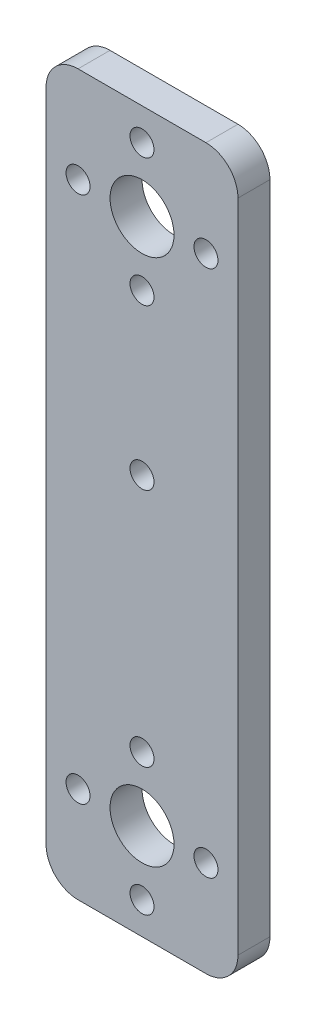
ISO-10303-21;
HEADER;
FILE_DESCRIPTION(('STEP AP214'),'2;1');
FILE_NAME('part.step','',(''),(''),'','','');
FILE_SCHEMA(('AUTOMOTIVE_DESIGN { 1 0 10303 214 1 1 1 1 }'));
ENDSEC;
DATA;
#1=APPLICATION_CONTEXT('core data for automotive mechanical design processes');
#2=APPLICATION_PROTOCOL_DEFINITION('international standard','automotive_design',2000,#1);
#3=PRODUCT_CONTEXT('',#1,'mechanical');
#4=PRODUCT('Part','Part','',(#3));
#5=PRODUCT_RELATED_PRODUCT_CATEGORY('part','',(#4));
#6=PRODUCT_DEFINITION_FORMATION('','',#4);
#7=PRODUCT_DEFINITION_CONTEXT('part definition',#1,'design');
#8=PRODUCT_DEFINITION('design','',#6,#7);
#9=PRODUCT_DEFINITION_SHAPE('','',#8);
#10=(LENGTH_UNIT() NAMED_UNIT(*) SI_UNIT(.MILLI.,.METRE.));
#11=(NAMED_UNIT(*) PLANE_ANGLE_UNIT() SI_UNIT($,.RADIAN.));
#12=(NAMED_UNIT(*) SI_UNIT($,.STERADIAN.) SOLID_ANGLE_UNIT());
#13=UNCERTAINTY_MEASURE_WITH_UNIT(LENGTH_MEASURE(1.E-05),#10,'distance_accuracy_value','');
#14=(GEOMETRIC_REPRESENTATION_CONTEXT(3) GLOBAL_UNCERTAINTY_ASSIGNED_CONTEXT((#13)) GLOBAL_UNIT_ASSIGNED_CONTEXT((#10,
#11,#12)) REPRESENTATION_CONTEXT('',''));
#15=CARTESIAN_POINT('',(0.,0.,0.));
#16=DIRECTION('',(0.,0.,1.));
#17=DIRECTION('',(1.,0.,0.));
#18=AXIS2_PLACEMENT_3D('',#15,#16,#17);
#19=CARTESIAN_POINT('',(-57.2966754660947,34.9503189792664,4.));
#20=DIRECTION('',(0.,1.,0.));
#21=DIRECTION('',(0.,0.,1.));
#22=AXIS2_PLACEMENT_3D('',#19,#20,#21);
#23=PLANE('',#22);
#24=DIRECTION('',(1.,0.,0.));
#25=VECTOR('',#24,1.);
#26=CARTESIAN_POINT('',(-57.2966754660947,34.9503189792664,0.));
#27=LINE('',#26,#25);
#28=CARTESIAN_POINT('',(-53.2966754660947,34.9503189792664,0.));
#29=VERTEX_POINT('',#28);
#30=CARTESIAN_POINT('',(-37.2966754660947,34.9503189792664,0.));
#31=VERTEX_POINT('',#30);
#32=EDGE_CURVE('E128',#29,#31,#27,.T.);
#33=ORIENTED_EDGE('',*,*,#32,.F.);
#34=DIRECTION('',(0.,0.,-1.));
#35=VECTOR('',#34,1.);
#36=CARTESIAN_POINT('',(-53.2966754660947,34.9503189792664,4.));
#37=LINE('',#36,#35);
#38=CARTESIAN_POINT('',(-53.2966754660947,34.9503189792664,4.));
#39=VERTEX_POINT('',#38);
#40=EDGE_CURVE('E11',#29,#39,#37,.F.);
#41=ORIENTED_EDGE('',*,*,#40,.T.);
#42=DIRECTION('',(1.,0.,0.));
#43=VECTOR('',#42,1.);
#44=CARTESIAN_POINT('',(-57.2966754660947,34.9503189792664,4.));
#45=LINE('',#44,#43);
#46=CARTESIAN_POINT('',(-37.2966754660947,34.9503189792664,4.));
#47=VERTEX_POINT('',#46);
#48=EDGE_CURVE('E126',#39,#47,#45,.T.);
#49=ORIENTED_EDGE('',*,*,#48,.T.);
#50=DIRECTION('',(0.,0.,-1.));
#51=VECTOR('',#50,1.);
#52=CARTESIAN_POINT('',(-37.2966754660947,34.9503189792664,4.));
#53=LINE('',#52,#51);
#54=EDGE_CURVE('E40',#47,#31,#53,.T.);
#55=ORIENTED_EDGE('',*,*,#54,.T.);
#56=EDGE_LOOP('',(#33,#41,#49,#55));
#57=FACE_BOUND('',#56,.T.);
#58=ADVANCED_FACE('F32',(#57),#23,.T.);
#59=CARTESIAN_POINT('',(-57.2966754660947,34.9503189792664,4.));
#60=DIRECTION('',(1.,0.,0.));
#61=DIRECTION('',(0.,1.,0.));
#62=AXIS2_PLACEMENT_3D('',#59,#60,#61);
#63=PLANE('',#62);
#64=DIRECTION('',(0.,-1.,0.));
#65=VECTOR('',#64,1.);
#66=CARTESIAN_POINT('',(-57.2966754660947,34.9503189792664,0.));
#67=LINE('',#66,#65);
#68=CARTESIAN_POINT('',(-57.2966754660947,30.9503189792664,0.));
#69=VERTEX_POINT('',#68);
#70=CARTESIAN_POINT('',(-57.2966754660947,-51.0496810207336,0.));
#71=VERTEX_POINT('',#70);
#72=EDGE_CURVE('E123',#69,#71,#67,.T.);
#73=ORIENTED_EDGE('',*,*,#72,.T.);
#74=DIRECTION('',(0.,0.,-1.));
#75=VECTOR('',#74,1.);
#76=CARTESIAN_POINT('',(-57.2966754660947,-51.0496810207336,4.));
#77=LINE('',#76,#75);
#78=CARTESIAN_POINT('',(-57.2966754660947,-51.0496810207336,4.));
#79=VERTEX_POINT('',#78);
#80=EDGE_CURVE('E103',#71,#79,#77,.F.);
#81=ORIENTED_EDGE('',*,*,#80,.T.);
#82=DIRECTION('',(0.,-1.,0.));
#83=VECTOR('',#82,1.);
#84=CARTESIAN_POINT('',(-57.2966754660947,34.9503189792664,4.));
#85=LINE('',#84,#83);
#86=CARTESIAN_POINT('',(-57.2966754660947,30.9503189792664,4.));
#87=VERTEX_POINT('',#86);
#88=EDGE_CURVE('E132',#87,#79,#85,.T.);
#89=ORIENTED_EDGE('',*,*,#88,.F.);
#90=DIRECTION('',(0.,0.,-1.));
#91=VECTOR('',#90,1.);
#92=CARTESIAN_POINT('',(-57.2966754660947,30.9503189792664,0.));
#93=LINE('',#92,#91);
#94=EDGE_CURVE('E108',#87,#69,#93,.T.);
#95=ORIENTED_EDGE('',*,*,#94,.T.);
#96=EDGE_LOOP('',(#73,#81,#89,#95));
#97=FACE_BOUND('',#96,.T.);
#98=ADVANCED_FACE('F271',(#97),#63,.F.);
#99=CARTESIAN_POINT('',(-57.2966754660947,-55.0496810207336,4.));
#100=DIRECTION('',(0.,1.,0.));
#101=DIRECTION('',(0.,0.,1.));
#102=AXIS2_PLACEMENT_3D('',#99,#100,#101);
#103=PLANE('',#102);
#104=DIRECTION('',(1.,0.,0.));
#105=VECTOR('',#104,1.);
#106=CARTESIAN_POINT('',(-57.2966754660947,-55.0496810207336,4.));
#107=LINE('',#106,#105);
#108=CARTESIAN_POINT('',(-53.2966754660947,-55.0496810207336,4.));
#109=VERTEX_POINT('',#108);
#110=CARTESIAN_POINT('',(-37.2966754660947,-55.0496810207336,4.));
#111=VERTEX_POINT('',#110);
#112=EDGE_CURVE('E117',#109,#111,#107,.T.);
#113=ORIENTED_EDGE('',*,*,#112,.F.);
#114=DIRECTION('',(0.,0.,-1.));
#115=VECTOR('',#114,1.);
#116=CARTESIAN_POINT('',(-53.2966754660947,-55.0496810207336,4.));
#117=LINE('',#116,#115);
#118=CARTESIAN_POINT('',(-53.2966754660947,-55.0496810207336,0.));
#119=VERTEX_POINT('',#118);
#120=EDGE_CURVE('E102',#109,#119,#117,.T.);
#121=ORIENTED_EDGE('',*,*,#120,.T.);
#122=DIRECTION('',(1.,0.,0.));
#123=VECTOR('',#122,1.);
#124=CARTESIAN_POINT('',(-57.2966754660947,-55.0496810207336,0.));
#125=LINE('',#124,#123);
#126=CARTESIAN_POINT('',(-37.2966754660947,-55.0496810207336,0.));
#127=VERTEX_POINT('',#126);
#128=EDGE_CURVE('E115',#119,#127,#125,.T.);
#129=ORIENTED_EDGE('',*,*,#128,.T.);
#130=DIRECTION('',(0.,0.,-1.));
#131=VECTOR('',#130,1.);
#132=CARTESIAN_POINT('',(-37.2966754660947,-55.0496810207336,4.));
#133=LINE('',#132,#131);
#134=EDGE_CURVE('E119',#127,#111,#133,.F.);
#135=ORIENTED_EDGE('',*,*,#134,.T.);
#136=EDGE_LOOP('',(#113,#121,#129,#135));
#137=FACE_BOUND('',#136,.T.);
#138=ADVANCED_FACE('F114',(#137),#103,.F.);
#139=CARTESIAN_POINT('',(-33.2966754660947,34.9503189792664,4.));
#140=DIRECTION('',(1.,0.,0.));
#141=DIRECTION('',(0.,1.,0.));
#142=AXIS2_PLACEMENT_3D('',#139,#140,#141);
#143=PLANE('',#142);
#144=DIRECTION('',(0.,-1.,0.));
#145=VECTOR('',#144,1.);
#146=CARTESIAN_POINT('',(-33.2966754660947,34.9503189792664,4.));
#147=LINE('',#146,#145);
#148=CARTESIAN_POINT('',(-33.2966754660947,30.9503189792664,4.));
#149=VERTEX_POINT('',#148);
#150=CARTESIAN_POINT('',(-33.2966754660947,-51.0496810207336,4.));
#151=VERTEX_POINT('',#150);
#152=EDGE_CURVE('E169',#149,#151,#147,.T.);
#153=ORIENTED_EDGE('',*,*,#152,.T.);
#154=DIRECTION('',(0.,0.,-1.));
#155=VECTOR('',#154,1.);
#156=CARTESIAN_POINT('',(-33.2966754660947,-51.0496810207336,0.));
#157=LINE('',#156,#155);
#158=CARTESIAN_POINT('',(-33.2966754660947,-51.0496810207336,0.));
#159=VERTEX_POINT('',#158);
#160=EDGE_CURVE('E149',#151,#159,#157,.T.);
#161=ORIENTED_EDGE('',*,*,#160,.T.);
#162=DIRECTION('',(0.,-1.,0.));
#163=VECTOR('',#162,1.);
#164=CARTESIAN_POINT('',(-33.2966754660947,34.9503189792664,0.));
#165=LINE('',#164,#163);
#166=CARTESIAN_POINT('',(-33.2966754660947,30.9503189792664,0.));
#167=VERTEX_POINT('',#166);
#168=EDGE_CURVE('E124',#167,#159,#165,.T.);
#169=ORIENTED_EDGE('',*,*,#168,.F.);
#170=DIRECTION('',(0.,0.,-1.));
#171=VECTOR('',#170,1.);
#172=CARTESIAN_POINT('',(-33.2966754660947,30.9503189792664,4.));
#173=LINE('',#172,#171);
#174=EDGE_CURVE('E54',#167,#149,#173,.F.);
#175=ORIENTED_EDGE('',*,*,#174,.T.);
#176=EDGE_LOOP('',(#153,#161,#169,#175));
#177=FACE_BOUND('',#176,.T.);
#178=ADVANCED_FACE('F246',(#177),#143,.T.);
#179=CARTESIAN_POINT('',(0.,0.,4.));
#180=DIRECTION('',(0.,0.,-1.));
#181=DIRECTION('',(-1.,0.,0.));
#182=AXIS2_PLACEMENT_3D('',#179,#180,#181);
#183=PLANE('',#182);
#184=CARTESIAN_POINT('',(-45.2966754660948,-5.04968102073364,4.));
#185=DIRECTION('',(0.,0.,1.));
#186=DIRECTION('',(1.,0.,0.));
#187=AXIS2_PLACEMENT_3D('',#184,#185,#186);
#188=CIRCLE('',#187,1.5);
#189=CARTESIAN_POINT('',(-43.7966754660948,-5.04968102073364,4.));
#190=VERTEX_POINT('',#189);
#191=EDGE_CURVE('E229',#190,#190,#188,.T.);
#192=ORIENTED_EDGE('',*,*,#191,.F.);
#193=EDGE_LOOP('',(#192));
#194=FACE_BOUND('',#193,.T.);
#195=CARTESIAN_POINT('',(-45.2966754660948,14.9503189792664,4.));
#196=DIRECTION('',(0.,0.,1.));
#197=DIRECTION('',(1.,0.,0.));
#198=AXIS2_PLACEMENT_3D('',#195,#196,#197);
#199=CIRCLE('',#198,1.5);
#200=CARTESIAN_POINT('',(-43.7966754660948,14.9503189792664,4.));
#201=VERTEX_POINT('',#200);
#202=EDGE_CURVE('E220',#201,#201,#199,.T.);
#203=ORIENTED_EDGE('',*,*,#202,.F.);
#204=EDGE_LOOP('',(#203));
#205=FACE_BOUND('',#204,.T.);
#206=CARTESIAN_POINT('',(-37.2966754660949,22.9503189792664,4.));
#207=DIRECTION('',(0.,0.,1.));
#208=DIRECTION('',(1.,0.,0.));
#209=AXIS2_PLACEMENT_3D('',#206,#207,#208);
#210=CIRCLE('',#209,1.5);
#211=CARTESIAN_POINT('',(-35.7966754660949,22.9503189792664,4.));
#212=VERTEX_POINT('',#211);
#213=EDGE_CURVE('E214',#212,#212,#210,.T.);
#214=ORIENTED_EDGE('',*,*,#213,.F.);
#215=EDGE_LOOP('',(#214));
#216=FACE_BOUND('',#215,.T.);
#217=CARTESIAN_POINT('',(-45.2966754660949,22.9503189792664,4.));
#218=DIRECTION('',(0.,0.,1.));
#219=DIRECTION('',(1.,0.,0.));
#220=AXIS2_PLACEMENT_3D('',#217,#218,#219);
#221=CIRCLE('',#220,4.);
#222=CARTESIAN_POINT('',(-41.2966754660949,22.9503189792664,4.));
#223=VERTEX_POINT('',#222);
#224=EDGE_CURVE('E208',#223,#223,#221,.T.);
#225=ORIENTED_EDGE('',*,*,#224,.F.);
#226=EDGE_LOOP('',(#225));
#227=FACE_BOUND('',#226,.T.);
#228=CARTESIAN_POINT('',(-45.2966754660949,30.9503189792664,4.));
#229=DIRECTION('',(0.,0.,1.));
#230=DIRECTION('',(1.,0.,0.));
#231=AXIS2_PLACEMENT_3D('',#228,#229,#230);
#232=CIRCLE('',#231,1.5);
#233=CARTESIAN_POINT('',(-43.7966754660949,30.9503189792664,4.));
#234=VERTEX_POINT('',#233);
#235=EDGE_CURVE('E202',#234,#234,#232,.T.);
#236=ORIENTED_EDGE('',*,*,#235,.F.);
#237=EDGE_LOOP('',(#236));
#238=FACE_BOUND('',#237,.T.);
#239=CARTESIAN_POINT('',(-53.2966754660949,22.9503189792664,4.));
#240=DIRECTION('',(0.,0.,1.));
#241=DIRECTION('',(1.,0.,0.));
#242=AXIS2_PLACEMENT_3D('',#239,#240,#241);
#243=CIRCLE('',#242,1.5);
#244=CARTESIAN_POINT('',(-51.7966754660949,22.9503189792664,4.));
#245=VERTEX_POINT('',#244);
#246=EDGE_CURVE('E196',#245,#245,#243,.T.);
#247=ORIENTED_EDGE('',*,*,#246,.F.);
#248=EDGE_LOOP('',(#247));
#249=FACE_BOUND('',#248,.T.);
#250=CARTESIAN_POINT('',(-53.2966754660947,-43.0496810207337,4.));
#251=DIRECTION('',(0.,0.,1.));
#252=DIRECTION('',(1.,0.,0.));
#253=AXIS2_PLACEMENT_3D('',#250,#251,#252);
#254=CIRCLE('',#253,1.5);
#255=CARTESIAN_POINT('',(-51.7966754660947,-43.0496810207337,4.));
#256=VERTEX_POINT('',#255);
#257=EDGE_CURVE('E190',#256,#256,#254,.T.);
#258=ORIENTED_EDGE('',*,*,#257,.F.);
#259=EDGE_LOOP('',(#258));
#260=FACE_BOUND('',#259,.T.);
#261=CARTESIAN_POINT('',(-45.2966754660947,-51.0496810207337,4.));
#262=DIRECTION('',(0.,0.,1.));
#263=DIRECTION('',(1.,0.,0.));
#264=AXIS2_PLACEMENT_3D('',#261,#262,#263);
#265=CIRCLE('',#264,1.5);
#266=CARTESIAN_POINT('',(-43.7966754660947,-51.0496810207337,4.));
#267=VERTEX_POINT('',#266);
#268=EDGE_CURVE('E184',#267,#267,#265,.T.);
#269=ORIENTED_EDGE('',*,*,#268,.F.);
#270=EDGE_LOOP('',(#269));
#271=FACE_BOUND('',#270,.T.);
#272=CARTESIAN_POINT('',(-37.2966754660947,-43.0496810207336,4.));
#273=DIRECTION('',(0.,0.,1.));
#274=DIRECTION('',(1.,0.,0.));
#275=AXIS2_PLACEMENT_3D('',#272,#273,#274);
#276=CIRCLE('',#275,1.5);
#277=CARTESIAN_POINT('',(-35.7966754660947,-43.0496810207336,4.));
#278=VERTEX_POINT('',#277);
#279=EDGE_CURVE('E178',#278,#278,#276,.T.);
#280=ORIENTED_EDGE('',*,*,#279,.F.);
#281=EDGE_LOOP('',(#280));
#282=FACE_BOUND('',#281,.T.);
#283=CARTESIAN_POINT('',(-45.2966754660947,-43.0496810207337,4.));
#284=DIRECTION('',(0.,0.,1.));
#285=DIRECTION('',(1.,0.,0.));
#286=AXIS2_PLACEMENT_3D('',#283,#284,#285);
#287=CIRCLE('',#286,4.);
#288=CARTESIAN_POINT('',(-41.2966754660947,-43.0496810207337,4.));
#289=VERTEX_POINT('',#288);
#290=EDGE_CURVE('E173',#289,#289,#287,.T.);
#291=ORIENTED_EDGE('',*,*,#290,.F.);
#292=EDGE_LOOP('',(#291));
#293=FACE_BOUND('',#292,.T.);
#294=CARTESIAN_POINT('',(-45.2966754660947,-35.0496810207337,4.));
#295=DIRECTION('',(0.,0.,1.));
#296=DIRECTION('',(1.,0.,0.));
#297=AXIS2_PLACEMENT_3D('',#294,#295,#296);
#298=CIRCLE('',#297,1.5);
#299=CARTESIAN_POINT('',(-43.7966754660947,-35.0496810207337,4.));
#300=VERTEX_POINT('',#299);
#301=EDGE_CURVE('E163',#300,#300,#298,.T.);
#302=ORIENTED_EDGE('',*,*,#301,.F.);
#303=EDGE_LOOP('',(#302));
#304=FACE_BOUND('',#303,.T.);
#305=ORIENTED_EDGE('',*,*,#88,.T.);
#306=CARTESIAN_POINT('',(-53.2966754660947,-51.0496810207336,4.));
#307=DIRECTION('',(0.,0.,-1.));
#308=DIRECTION('',(-1.,0.,0.));
#309=AXIS2_PLACEMENT_3D('',#306,#307,#308);
#310=CIRCLE('',#309,4.);
#311=EDGE_CURVE('E146',#79,#109,#310,.F.);
#312=ORIENTED_EDGE('',*,*,#311,.T.);
#313=ORIENTED_EDGE('',*,*,#112,.T.);
#314=CARTESIAN_POINT('',(-37.2966754660947,-51.0496810207336,4.));
#315=DIRECTION('',(0.,0.,-1.));
#316=DIRECTION('',(-1.,0.,0.));
#317=AXIS2_PLACEMENT_3D('',#314,#315,#316);
#318=CIRCLE('',#317,4.);
#319=EDGE_CURVE('E47',#111,#151,#318,.F.);
#320=ORIENTED_EDGE('',*,*,#319,.T.);
#321=ORIENTED_EDGE('',*,*,#152,.F.);
#322=CARTESIAN_POINT('',(-37.2966754660947,30.9503189792664,4.));
#323=DIRECTION('',(0.,0.,-1.));
#324=DIRECTION('',(-1.,0.,0.));
#325=AXIS2_PLACEMENT_3D('',#322,#323,#324);
#326=CIRCLE('',#325,4.);
#327=EDGE_CURVE('E141',#149,#47,#326,.F.);
#328=ORIENTED_EDGE('',*,*,#327,.T.);
#329=ORIENTED_EDGE('',*,*,#48,.F.);
#330=CARTESIAN_POINT('',(-53.2966754660947,30.9503189792664,4.));
#331=DIRECTION('',(0.,0.,-1.));
#332=DIRECTION('',(-1.,0.,0.));
#333=AXIS2_PLACEMENT_3D('',#330,#331,#332);
#334=CIRCLE('',#333,4.);
#335=EDGE_CURVE('E143',#39,#87,#334,.F.);
#336=ORIENTED_EDGE('',*,*,#335,.T.);
#337=EDGE_LOOP('',(#305,#312,#313,#320,#321,#328,#329,#336));
#338=FACE_BOUND('',#337,.T.);
#339=ADVANCED_FACE('F243',(#194,#205,#216,#227,#238,#249,#260,#271,#282,#293,#304,#338),#183,.F.);
#340=CARTESIAN_POINT('',(0.,0.,0.));
#341=DIRECTION('',(0.,0.,-1.));
#342=DIRECTION('',(-1.,0.,0.));
#343=AXIS2_PLACEMENT_3D('',#340,#341,#342);
#344=PLANE('',#343);
#345=CARTESIAN_POINT('',(-45.2966754660948,-5.04968102073364,0.));
#346=DIRECTION('',(0.,0.,1.));
#347=DIRECTION('',(1.,0.,0.));
#348=AXIS2_PLACEMENT_3D('',#345,#346,#347);
#349=CIRCLE('',#348,1.5);
#350=CARTESIAN_POINT('',(-43.7966754660948,-5.04968102073364,0.));
#351=VERTEX_POINT('',#350);
#352=EDGE_CURVE('E226',#351,#351,#349,.T.);
#353=ORIENTED_EDGE('',*,*,#352,.T.);
#354=EDGE_LOOP('',(#353));
#355=FACE_BOUND('',#354,.T.);
#356=CARTESIAN_POINT('',(-45.2966754660948,14.9503189792664,0.));
#357=DIRECTION('',(0.,0.,1.));
#358=DIRECTION('',(1.,0.,0.));
#359=AXIS2_PLACEMENT_3D('',#356,#357,#358);
#360=CIRCLE('',#359,1.5);
#361=CARTESIAN_POINT('',(-43.7966754660948,14.9503189792664,0.));
#362=VERTEX_POINT('',#361);
#363=EDGE_CURVE('E223',#362,#362,#360,.T.);
#364=ORIENTED_EDGE('',*,*,#363,.T.);
#365=EDGE_LOOP('',(#364));
#366=FACE_BOUND('',#365,.T.);
#367=CARTESIAN_POINT('',(-37.2966754660949,22.9503189792664,0.));
#368=DIRECTION('',(0.,0.,1.));
#369=DIRECTION('',(1.,0.,0.));
#370=AXIS2_PLACEMENT_3D('',#367,#368,#369);
#371=CIRCLE('',#370,1.5);
#372=CARTESIAN_POINT('',(-35.7966754660949,22.9503189792664,0.));
#373=VERTEX_POINT('',#372);
#374=EDGE_CURVE('E217',#373,#373,#371,.T.);
#375=ORIENTED_EDGE('',*,*,#374,.T.);
#376=EDGE_LOOP('',(#375));
#377=FACE_BOUND('',#376,.T.);
#378=CARTESIAN_POINT('',(-45.2966754660949,22.9503189792664,0.));
#379=DIRECTION('',(0.,0.,1.));
#380=DIRECTION('',(1.,0.,0.));
#381=AXIS2_PLACEMENT_3D('',#378,#379,#380);
#382=CIRCLE('',#381,4.);
#383=CARTESIAN_POINT('',(-41.2966754660949,22.9503189792664,0.));
#384=VERTEX_POINT('',#383);
#385=EDGE_CURVE('E211',#384,#384,#382,.T.);
#386=ORIENTED_EDGE('',*,*,#385,.T.);
#387=EDGE_LOOP('',(#386));
#388=FACE_BOUND('',#387,.T.);
#389=CARTESIAN_POINT('',(-45.2966754660949,30.9503189792664,0.));
#390=DIRECTION('',(0.,0.,1.));
#391=DIRECTION('',(1.,0.,0.));
#392=AXIS2_PLACEMENT_3D('',#389,#390,#391);
#393=CIRCLE('',#392,1.5);
#394=CARTESIAN_POINT('',(-43.7966754660949,30.9503189792664,0.));
#395=VERTEX_POINT('',#394);
#396=EDGE_CURVE('E205',#395,#395,#393,.T.);
#397=ORIENTED_EDGE('',*,*,#396,.T.);
#398=EDGE_LOOP('',(#397));
#399=FACE_BOUND('',#398,.T.);
#400=CARTESIAN_POINT('',(-53.2966754660949,22.9503189792664,0.));
#401=DIRECTION('',(0.,0.,1.));
#402=DIRECTION('',(1.,0.,0.));
#403=AXIS2_PLACEMENT_3D('',#400,#401,#402);
#404=CIRCLE('',#403,1.5);
#405=CARTESIAN_POINT('',(-51.7966754660949,22.9503189792664,0.));
#406=VERTEX_POINT('',#405);
#407=EDGE_CURVE('E199',#406,#406,#404,.T.);
#408=ORIENTED_EDGE('',*,*,#407,.T.);
#409=EDGE_LOOP('',(#408));
#410=FACE_BOUND('',#409,.T.);
#411=CARTESIAN_POINT('',(-53.2966754660947,-43.0496810207337,0.));
#412=DIRECTION('',(0.,0.,1.));
#413=DIRECTION('',(1.,0.,0.));
#414=AXIS2_PLACEMENT_3D('',#411,#412,#413);
#415=CIRCLE('',#414,1.5);
#416=CARTESIAN_POINT('',(-51.7966754660947,-43.0496810207337,0.));
#417=VERTEX_POINT('',#416);
#418=EDGE_CURVE('E193',#417,#417,#415,.T.);
#419=ORIENTED_EDGE('',*,*,#418,.T.);
#420=EDGE_LOOP('',(#419));
#421=FACE_BOUND('',#420,.T.);
#422=CARTESIAN_POINT('',(-45.2966754660947,-51.0496810207337,0.));
#423=DIRECTION('',(0.,0.,1.));
#424=DIRECTION('',(1.,0.,0.));
#425=AXIS2_PLACEMENT_3D('',#422,#423,#424);
#426=CIRCLE('',#425,1.5);
#427=CARTESIAN_POINT('',(-43.7966754660947,-51.0496810207337,0.));
#428=VERTEX_POINT('',#427);
#429=EDGE_CURVE('E187',#428,#428,#426,.T.);
#430=ORIENTED_EDGE('',*,*,#429,.T.);
#431=EDGE_LOOP('',(#430));
#432=FACE_BOUND('',#431,.T.);
#433=CARTESIAN_POINT('',(-37.2966754660947,-43.0496810207336,0.));
#434=DIRECTION('',(0.,0.,1.));
#435=DIRECTION('',(1.,0.,0.));
#436=AXIS2_PLACEMENT_3D('',#433,#434,#435);
#437=CIRCLE('',#436,1.5);
#438=CARTESIAN_POINT('',(-35.7966754660947,-43.0496810207336,0.));
#439=VERTEX_POINT('',#438);
#440=EDGE_CURVE('E181',#439,#439,#437,.T.);
#441=ORIENTED_EDGE('',*,*,#440,.T.);
#442=EDGE_LOOP('',(#441));
#443=FACE_BOUND('',#442,.T.);
#444=CARTESIAN_POINT('',(-45.2966754660947,-43.0496810207337,0.));
#445=DIRECTION('',(0.,0.,1.));
#446=DIRECTION('',(1.,0.,0.));
#447=AXIS2_PLACEMENT_3D('',#444,#445,#446);
#448=CIRCLE('',#447,4.);
#449=CARTESIAN_POINT('',(-41.2966754660947,-43.0496810207337,0.));
#450=VERTEX_POINT('',#449);
#451=EDGE_CURVE('E175',#450,#450,#448,.T.);
#452=ORIENTED_EDGE('',*,*,#451,.T.);
#453=EDGE_LOOP('',(#452));
#454=FACE_BOUND('',#453,.T.);
#455=CARTESIAN_POINT('',(-45.2966754660947,-35.0496810207337,0.));
#456=DIRECTION('',(0.,0.,1.));
#457=DIRECTION('',(1.,0.,0.));
#458=AXIS2_PLACEMENT_3D('',#455,#456,#457);
#459=CIRCLE('',#458,1.5);
#460=CARTESIAN_POINT('',(-43.7966754660947,-35.0496810207337,0.));
#461=VERTEX_POINT('',#460);
#462=EDGE_CURVE('E161',#461,#461,#459,.T.);
#463=ORIENTED_EDGE('',*,*,#462,.T.);
#464=EDGE_LOOP('',(#463));
#465=FACE_BOUND('',#464,.T.);
#466=ORIENTED_EDGE('',*,*,#128,.F.);
#467=CARTESIAN_POINT('',(-53.2966754660947,-51.0496810207336,0.));
#468=DIRECTION('',(0.,0.,-1.));
#469=DIRECTION('',(-1.,0.,0.));
#470=AXIS2_PLACEMENT_3D('',#467,#468,#469);
#471=CIRCLE('',#470,4.);
#472=EDGE_CURVE('E98',#119,#71,#471,.T.);
#473=ORIENTED_EDGE('',*,*,#472,.T.);
#474=ORIENTED_EDGE('',*,*,#72,.F.);
#475=CARTESIAN_POINT('',(-53.2966754660947,30.9503189792664,0.));
#476=DIRECTION('',(0.,0.,-1.));
#477=DIRECTION('',(-1.,0.,0.));
#478=AXIS2_PLACEMENT_3D('',#475,#476,#477);
#479=CIRCLE('',#478,4.);
#480=EDGE_CURVE('E135',#69,#29,#479,.T.);
#481=ORIENTED_EDGE('',*,*,#480,.T.);
#482=ORIENTED_EDGE('',*,*,#32,.T.);
#483=CARTESIAN_POINT('',(-37.2966754660947,30.9503189792664,0.));
#484=DIRECTION('',(0.,0.,-1.));
#485=DIRECTION('',(-1.,0.,0.));
#486=AXIS2_PLACEMENT_3D('',#483,#484,#485);
#487=CIRCLE('',#486,4.);
#488=EDGE_CURVE('E118',#31,#167,#487,.T.);
#489=ORIENTED_EDGE('',*,*,#488,.T.);
#490=ORIENTED_EDGE('',*,*,#168,.T.);
#491=CARTESIAN_POINT('',(-37.2966754660947,-51.0496810207336,0.));
#492=DIRECTION('',(0.,0.,-1.));
#493=DIRECTION('',(-1.,0.,0.));
#494=AXIS2_PLACEMENT_3D('',#491,#492,#493);
#495=CIRCLE('',#494,4.);
#496=EDGE_CURVE('E109',#159,#127,#495,.T.);
#497=ORIENTED_EDGE('',*,*,#496,.T.);
#498=EDGE_LOOP('',(#466,#473,#474,#481,#482,#489,#490,#497));
#499=FACE_BOUND('',#498,.T.);
#500=ADVANCED_FACE('F121',(#355,#366,#377,#388,#399,#410,#421,#432,#443,#454,#465,#499),#344,.T.);
#501=CARTESIAN_POINT('',(-45.2966754660947,-35.0496810207337,0.));
#502=DIRECTION('',(0.,0.,1.));
#503=DIRECTION('',(1.,0.,0.));
#504=AXIS2_PLACEMENT_3D('',#501,#502,#503);
#505=CYLINDRICAL_SURFACE('',#504,1.5);
#506=ORIENTED_EDGE('',*,*,#462,.F.);
#507=EDGE_LOOP('',(#506));
#508=FACE_BOUND('',#507,.T.);
#509=ORIENTED_EDGE('',*,*,#301,.T.);
#510=EDGE_LOOP('',(#509));
#511=FACE_BOUND('',#510,.T.);
#512=ADVANCED_FACE('F304',(#508,#511),#505,.F.);
#513=CARTESIAN_POINT('',(-45.2966754660947,-43.0496810207337,0.));
#514=DIRECTION('',(0.,0.,1.));
#515=DIRECTION('',(1.,0.,0.));
#516=AXIS2_PLACEMENT_3D('',#513,#514,#515);
#517=CYLINDRICAL_SURFACE('',#516,4.);
#518=ORIENTED_EDGE('',*,*,#451,.F.);
#519=EDGE_LOOP('',(#518));
#520=FACE_BOUND('',#519,.T.);
#521=ORIENTED_EDGE('',*,*,#290,.T.);
#522=EDGE_LOOP('',(#521));
#523=FACE_BOUND('',#522,.T.);
#524=ADVANCED_FACE('F308',(#520,#523),#517,.F.);
#525=CARTESIAN_POINT('',(-37.2966754660947,-43.0496810207336,0.));
#526=DIRECTION('',(0.,0.,1.));
#527=DIRECTION('',(1.,0.,0.));
#528=AXIS2_PLACEMENT_3D('',#525,#526,#527);
#529=CYLINDRICAL_SURFACE('',#528,1.5);
#530=ORIENTED_EDGE('',*,*,#440,.F.);
#531=EDGE_LOOP('',(#530));
#532=FACE_BOUND('',#531,.T.);
#533=ORIENTED_EDGE('',*,*,#279,.T.);
#534=EDGE_LOOP('',(#533));
#535=FACE_BOUND('',#534,.T.);
#536=ADVANCED_FACE('F312',(#532,#535),#529,.F.);
#537=CARTESIAN_POINT('',(-45.2966754660947,-51.0496810207337,0.));
#538=DIRECTION('',(0.,0.,1.));
#539=DIRECTION('',(1.,0.,0.));
#540=AXIS2_PLACEMENT_3D('',#537,#538,#539);
#541=CYLINDRICAL_SURFACE('',#540,1.5);
#542=ORIENTED_EDGE('',*,*,#429,.F.);
#543=EDGE_LOOP('',(#542));
#544=FACE_BOUND('',#543,.T.);
#545=ORIENTED_EDGE('',*,*,#268,.T.);
#546=EDGE_LOOP('',(#545));
#547=FACE_BOUND('',#546,.T.);
#548=ADVANCED_FACE('F316',(#544,#547),#541,.F.);
#549=CARTESIAN_POINT('',(-53.2966754660947,-43.0496810207337,0.));
#550=DIRECTION('',(0.,0.,1.));
#551=DIRECTION('',(1.,0.,0.));
#552=AXIS2_PLACEMENT_3D('',#549,#550,#551);
#553=CYLINDRICAL_SURFACE('',#552,1.5);
#554=ORIENTED_EDGE('',*,*,#418,.F.);
#555=EDGE_LOOP('',(#554));
#556=FACE_BOUND('',#555,.T.);
#557=ORIENTED_EDGE('',*,*,#257,.T.);
#558=EDGE_LOOP('',(#557));
#559=FACE_BOUND('',#558,.T.);
#560=ADVANCED_FACE('F320',(#556,#559),#553,.F.);
#561=CARTESIAN_POINT('',(-53.2966754660949,22.9503189792664,0.));
#562=DIRECTION('',(0.,0.,1.));
#563=DIRECTION('',(1.,0.,0.));
#564=AXIS2_PLACEMENT_3D('',#561,#562,#563);
#565=CYLINDRICAL_SURFACE('',#564,1.5);
#566=ORIENTED_EDGE('',*,*,#407,.F.);
#567=EDGE_LOOP('',(#566));
#568=FACE_BOUND('',#567,.T.);
#569=ORIENTED_EDGE('',*,*,#246,.T.);
#570=EDGE_LOOP('',(#569));
#571=FACE_BOUND('',#570,.T.);
#572=ADVANCED_FACE('F324',(#568,#571),#565,.F.);
#573=CARTESIAN_POINT('',(-45.2966754660949,30.9503189792664,0.));
#574=DIRECTION('',(0.,0.,1.));
#575=DIRECTION('',(1.,0.,0.));
#576=AXIS2_PLACEMENT_3D('',#573,#574,#575);
#577=CYLINDRICAL_SURFACE('',#576,1.5);
#578=ORIENTED_EDGE('',*,*,#396,.F.);
#579=EDGE_LOOP('',(#578));
#580=FACE_BOUND('',#579,.T.);
#581=ORIENTED_EDGE('',*,*,#235,.T.);
#582=EDGE_LOOP('',(#581));
#583=FACE_BOUND('',#582,.T.);
#584=ADVANCED_FACE('F328',(#580,#583),#577,.F.);
#585=CARTESIAN_POINT('',(-45.2966754660949,22.9503189792664,0.));
#586=DIRECTION('',(0.,0.,1.));
#587=DIRECTION('',(1.,0.,0.));
#588=AXIS2_PLACEMENT_3D('',#585,#586,#587);
#589=CYLINDRICAL_SURFACE('',#588,4.);
#590=ORIENTED_EDGE('',*,*,#385,.F.);
#591=EDGE_LOOP('',(#590));
#592=FACE_BOUND('',#591,.T.);
#593=ORIENTED_EDGE('',*,*,#224,.T.);
#594=EDGE_LOOP('',(#593));
#595=FACE_BOUND('',#594,.T.);
#596=ADVANCED_FACE('F332',(#592,#595),#589,.F.);
#597=CARTESIAN_POINT('',(-37.2966754660949,22.9503189792664,0.));
#598=DIRECTION('',(0.,0.,1.));
#599=DIRECTION('',(1.,0.,0.));
#600=AXIS2_PLACEMENT_3D('',#597,#598,#599);
#601=CYLINDRICAL_SURFACE('',#600,1.5);
#602=ORIENTED_EDGE('',*,*,#374,.F.);
#603=EDGE_LOOP('',(#602));
#604=FACE_BOUND('',#603,.T.);
#605=ORIENTED_EDGE('',*,*,#213,.T.);
#606=EDGE_LOOP('',(#605));
#607=FACE_BOUND('',#606,.T.);
#608=ADVANCED_FACE('F336',(#604,#607),#601,.F.);
#609=CARTESIAN_POINT('',(-45.2966754660948,14.9503189792664,0.));
#610=DIRECTION('',(0.,0.,1.));
#611=DIRECTION('',(1.,0.,0.));
#612=AXIS2_PLACEMENT_3D('',#609,#610,#611);
#613=CYLINDRICAL_SURFACE('',#612,1.5);
#614=ORIENTED_EDGE('',*,*,#363,.F.);
#615=EDGE_LOOP('',(#614));
#616=FACE_BOUND('',#615,.T.);
#617=ORIENTED_EDGE('',*,*,#202,.T.);
#618=EDGE_LOOP('',(#617));
#619=FACE_BOUND('',#618,.T.);
#620=ADVANCED_FACE('F290',(#616,#619),#613,.F.);
#621=CARTESIAN_POINT('',(-53.2966754660947,-51.0496810207336,4.));
#622=DIRECTION('',(0.,0.,-1.));
#623=DIRECTION('',(-1.,0.,0.));
#624=AXIS2_PLACEMENT_3D('',#621,#622,#623);
#625=CYLINDRICAL_SURFACE('',#624,4.);
#626=ORIENTED_EDGE('',*,*,#311,.F.);
#627=ORIENTED_EDGE('',*,*,#80,.F.);
#628=ORIENTED_EDGE('',*,*,#472,.F.);
#629=ORIENTED_EDGE('',*,*,#120,.F.);
#630=EDGE_LOOP('',(#626,#627,#628,#629));
#631=FACE_BOUND('',#630,.T.);
#632=ADVANCED_FACE('F101',(#631),#625,.T.);
#633=CARTESIAN_POINT('',(-37.2966754660947,-51.0496810207336,4.));
#634=DIRECTION('',(0.,0.,1.));
#635=DIRECTION('',(1.,0.,0.));
#636=AXIS2_PLACEMENT_3D('',#633,#634,#635);
#637=CYLINDRICAL_SURFACE('',#636,4.);
#638=ORIENTED_EDGE('',*,*,#319,.F.);
#639=ORIENTED_EDGE('',*,*,#134,.F.);
#640=ORIENTED_EDGE('',*,*,#496,.F.);
#641=ORIENTED_EDGE('',*,*,#160,.F.);
#642=EDGE_LOOP('',(#638,#639,#640,#641));
#643=FACE_BOUND('',#642,.T.);
#644=ADVANCED_FACE('F278',(#643),#637,.T.);
#645=CARTESIAN_POINT('',(-53.2966754660947,30.9503189792664,4.));
#646=DIRECTION('',(0.,0.,1.));
#647=DIRECTION('',(1.,0.,0.));
#648=AXIS2_PLACEMENT_3D('',#645,#646,#647);
#649=CYLINDRICAL_SURFACE('',#648,4.);
#650=ORIENTED_EDGE('',*,*,#335,.F.);
#651=ORIENTED_EDGE('',*,*,#40,.F.);
#652=ORIENTED_EDGE('',*,*,#480,.F.);
#653=ORIENTED_EDGE('',*,*,#94,.F.);
#654=EDGE_LOOP('',(#650,#651,#652,#653));
#655=FACE_BOUND('',#654,.T.);
#656=ADVANCED_FACE('F273',(#655),#649,.T.);
#657=CARTESIAN_POINT('',(-37.2966754660947,30.9503189792664,4.));
#658=DIRECTION('',(0.,0.,-1.));
#659=DIRECTION('',(-1.,0.,0.));
#660=AXIS2_PLACEMENT_3D('',#657,#658,#659);
#661=CYLINDRICAL_SURFACE('',#660,4.);
#662=ORIENTED_EDGE('',*,*,#327,.F.);
#663=ORIENTED_EDGE('',*,*,#174,.F.);
#664=ORIENTED_EDGE('',*,*,#488,.F.);
#665=ORIENTED_EDGE('',*,*,#54,.F.);
#666=EDGE_LOOP('',(#662,#663,#664,#665));
#667=FACE_BOUND('',#666,.T.);
#668=ADVANCED_FACE('F34',(#667),#661,.T.);
#669=CARTESIAN_POINT('',(-45.2966754660948,-5.04968102073364,0.));
#670=DIRECTION('',(0.,0.,1.));
#671=DIRECTION('',(1.,0.,0.));
#672=AXIS2_PLACEMENT_3D('',#669,#670,#671);
#673=CYLINDRICAL_SURFACE('',#672,1.5);
#674=ORIENTED_EDGE('',*,*,#352,.F.);
#675=EDGE_LOOP('',(#674));
#676=FACE_BOUND('',#675,.T.);
#677=ORIENTED_EDGE('',*,*,#191,.T.);
#678=EDGE_LOOP('',(#677));
#679=FACE_BOUND('',#678,.T.);
#680=ADVANCED_FACE('F237',(#676,#679),#673,.F.);
#681=CLOSED_SHELL('',(#58,#98,#138,#178,#339,#500,#512,#524,#536,#548,#560,#572,#584,#596,#608,
#620,#632,#644,#656,#668,#680));
#682=MANIFOLD_SOLID_BREP('B2',#681);
#683=ADVANCED_BREP_SHAPE_REPRESENTATION('',(#18,#682),#14);
#684=SHAPE_DEFINITION_REPRESENTATION(#9,#683);
ENDSEC;
END-ISO-10303-21;
